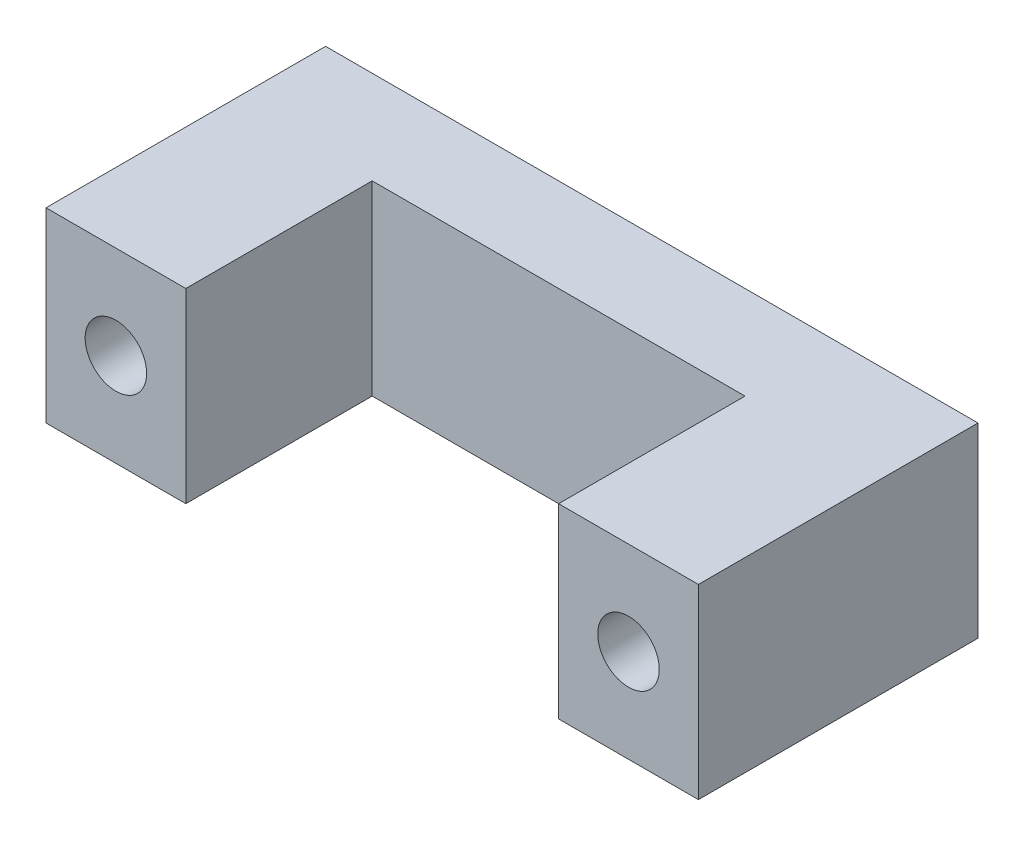
ISO-10303-21;
HEADER;
FILE_DESCRIPTION(('STEP AP214'),'2;1');
FILE_NAME('part.step','',(''),(''),'','','');
FILE_SCHEMA(('AUTOMOTIVE_DESIGN { 1 0 10303 214 1 1 1 1 }'));
ENDSEC;
DATA;
#1=APPLICATION_CONTEXT('core data for automotive mechanical design processes');
#2=APPLICATION_PROTOCOL_DEFINITION('international standard','automotive_design',2000,#1);
#3=PRODUCT_CONTEXT('',#1,'mechanical');
#4=PRODUCT('Part','Part','',(#3));
#5=PRODUCT_RELATED_PRODUCT_CATEGORY('part','',(#4));
#6=PRODUCT_DEFINITION_FORMATION('','',#4);
#7=PRODUCT_DEFINITION_CONTEXT('part definition',#1,'design');
#8=PRODUCT_DEFINITION('design','',#6,#7);
#9=PRODUCT_DEFINITION_SHAPE('','',#8);
#10=(LENGTH_UNIT() NAMED_UNIT(*) SI_UNIT(.MILLI.,.METRE.));
#11=(NAMED_UNIT(*) PLANE_ANGLE_UNIT() SI_UNIT($,.RADIAN.));
#12=(NAMED_UNIT(*) SI_UNIT($,.STERADIAN.) SOLID_ANGLE_UNIT());
#13=UNCERTAINTY_MEASURE_WITH_UNIT(LENGTH_MEASURE(1.E-05),#10,'distance_accuracy_value','');
#14=(GEOMETRIC_REPRESENTATION_CONTEXT(3) GLOBAL_UNCERTAINTY_ASSIGNED_CONTEXT((#13)) GLOBAL_UNIT_ASSIGNED_CONTEXT((#10,
#11,#12)) REPRESENTATION_CONTEXT('',''));
#15=CARTESIAN_POINT('',(0.,0.,0.));
#16=DIRECTION('',(0.,0.,1.));
#17=DIRECTION('',(1.,0.,0.));
#18=AXIS2_PLACEMENT_3D('',#15,#16,#17);
#19=CARTESIAN_POINT('',(0.,0.,15.));
#20=DIRECTION('',(0.,0.,1.));
#21=DIRECTION('',(1.,0.,0.));
#22=AXIS2_PLACEMENT_3D('',#19,#20,#21);
#23=PLANE('',#22);
#24=DIRECTION('',(0.,-1.,0.));
#25=VECTOR('',#24,1.);
#26=CARTESIAN_POINT('',(-10.,-5.00000000000002,15.));
#27=LINE('',#26,#25);
#28=CARTESIAN_POINT('',(-10.,5.00000000000002,15.));
#29=VERTEX_POINT('',#28);
#30=CARTESIAN_POINT('',(-10.,-5.00000000000002,15.));
#31=VERTEX_POINT('',#30);
#32=EDGE_CURVE('E112',#29,#31,#27,.T.);
#33=ORIENTED_EDGE('',*,*,#32,.F.);
#34=DIRECTION('',(-1.,0.,0.));
#35=VECTOR('',#34,1.);
#36=CARTESIAN_POINT('',(17.5,5.00000000000002,15.));
#37=LINE('',#36,#35);
#38=CARTESIAN_POINT('',(-17.5,5.00000000000001,15.));
#39=VERTEX_POINT('',#38);
#40=EDGE_CURVE('E57',#29,#39,#37,.T.);
#41=ORIENTED_EDGE('',*,*,#40,.T.);
#42=DIRECTION('',(0.,-1.,0.));
#43=VECTOR('',#42,1.);
#44=CARTESIAN_POINT('',(-17.5,-4.99999999999999,15.));
#45=LINE('',#44,#43);
#46=CARTESIAN_POINT('',(-17.5,-4.99999999999999,15.));
#47=VERTEX_POINT('',#46);
#48=EDGE_CURVE('E151',#39,#47,#45,.T.);
#49=ORIENTED_EDGE('',*,*,#48,.T.);
#50=DIRECTION('',(1.,0.,0.));
#51=VECTOR('',#50,1.);
#52=CARTESIAN_POINT('',(17.5,-4.99999999999998,15.));
#53=LINE('',#52,#51);
#54=EDGE_CURVE('E86',#47,#31,#53,.T.);
#55=ORIENTED_EDGE('',*,*,#54,.T.);
#56=EDGE_LOOP('',(#33,#41,#49,#55));
#57=FACE_BOUND('',#56,.T.);
#58=CARTESIAN_POINT('',(-13.75,0.,15.));
#59=DIRECTION('',(0.,0.,1.));
#60=DIRECTION('',(1.,0.,0.));
#61=AXIS2_PLACEMENT_3D('',#58,#59,#60);
#62=CIRCLE('',#61,1.65);
#63=CARTESIAN_POINT('',(-12.1,0.,15.));
#64=VERTEX_POINT('',#63);
#65=EDGE_CURVE('E145',#64,#64,#62,.T.);
#66=ORIENTED_EDGE('',*,*,#65,.F.);
#67=EDGE_LOOP('',(#66));
#68=FACE_BOUND('',#67,.T.);
#69=ADVANCED_FACE('F33',(#57,#68),#23,.T.);
#70=DIRECTION('',(0.,1.,0.));
#71=VECTOR('',#70,1.);
#72=CARTESIAN_POINT('',(10.,-5.00000000000002,15.));
#73=LINE('',#72,#71);
#74=CARTESIAN_POINT('',(10.,-5.00000000000002,15.));
#75=VERTEX_POINT('',#74);
#76=CARTESIAN_POINT('',(10.,5.00000000000002,15.));
#77=VERTEX_POINT('',#76);
#78=EDGE_CURVE('E122',#75,#77,#73,.T.);
#79=ORIENTED_EDGE('',*,*,#78,.F.);
#80=CARTESIAN_POINT('',(17.5,-4.99999999999998,15.));
#81=VERTEX_POINT('',#80);
#82=EDGE_CURVE('E153',#75,#81,#53,.T.);
#83=ORIENTED_EDGE('',*,*,#82,.T.);
#84=DIRECTION('',(0.,1.,0.));
#85=VECTOR('',#84,1.);
#86=CARTESIAN_POINT('',(17.5,-4.99999999999998,15.));
#87=LINE('',#86,#85);
#88=CARTESIAN_POINT('',(17.5,5.00000000000002,15.));
#89=VERTEX_POINT('',#88);
#90=EDGE_CURVE('E155',#81,#89,#87,.T.);
#91=ORIENTED_EDGE('',*,*,#90,.T.);
#92=EDGE_CURVE('E157',#89,#77,#37,.T.);
#93=ORIENTED_EDGE('',*,*,#92,.T.);
#94=EDGE_LOOP('',(#79,#83,#91,#93));
#95=FACE_BOUND('',#94,.T.);
#96=CARTESIAN_POINT('',(13.75,0.,15.));
#97=DIRECTION('',(0.,0.,1.));
#98=DIRECTION('',(-1.,0.,0.));
#99=AXIS2_PLACEMENT_3D('',#96,#97,#98);
#100=CIRCLE('',#99,1.65);
#101=CARTESIAN_POINT('',(12.1,0.,15.));
#102=VERTEX_POINT('',#101);
#103=EDGE_CURVE('E139',#102,#102,#100,.T.);
#104=ORIENTED_EDGE('',*,*,#103,.F.);
#105=EDGE_LOOP('',(#104));
#106=FACE_BOUND('',#105,.T.);
#107=ADVANCED_FACE('F187',(#95,#106),#23,.T.);
#108=CARTESIAN_POINT('',(0.,0.,0.));
#109=DIRECTION('',(0.,0.,1.));
#110=DIRECTION('',(1.,0.,0.));
#111=AXIS2_PLACEMENT_3D('',#108,#109,#110);
#112=PLANE('',#111);
#113=DIRECTION('',(0.,-1.,0.));
#114=VECTOR('',#113,1.);
#115=CARTESIAN_POINT('',(-17.5,-4.99999999999999,0.));
#116=LINE('',#115,#114);
#117=CARTESIAN_POINT('',(-17.5,5.00000000000001,0.));
#118=VERTEX_POINT('',#117);
#119=CARTESIAN_POINT('',(-17.5,-4.99999999999999,0.));
#120=VERTEX_POINT('',#119);
#121=EDGE_CURVE('E148',#118,#120,#116,.T.);
#122=ORIENTED_EDGE('',*,*,#121,.F.);
#123=DIRECTION('',(-1.,0.,0.));
#124=VECTOR('',#123,1.);
#125=CARTESIAN_POINT('',(17.5,5.00000000000002,0.));
#126=LINE('',#125,#124);
#127=CARTESIAN_POINT('',(17.5,5.00000000000002,0.));
#128=VERTEX_POINT('',#127);
#129=EDGE_CURVE('E79',#128,#118,#126,.T.);
#130=ORIENTED_EDGE('',*,*,#129,.F.);
#131=DIRECTION('',(0.,1.,0.));
#132=VECTOR('',#131,1.);
#133=CARTESIAN_POINT('',(17.5,-4.99999999999998,0.));
#134=LINE('',#133,#132);
#135=CARTESIAN_POINT('',(17.5,-4.99999999999998,0.));
#136=VERTEX_POINT('',#135);
#137=EDGE_CURVE('E165',#136,#128,#134,.T.);
#138=ORIENTED_EDGE('',*,*,#137,.F.);
#139=DIRECTION('',(1.,0.,0.));
#140=VECTOR('',#139,1.);
#141=CARTESIAN_POINT('',(17.5,-4.99999999999998,0.));
#142=LINE('',#141,#140);
#143=EDGE_CURVE('E163',#120,#136,#142,.T.);
#144=ORIENTED_EDGE('',*,*,#143,.F.);
#145=EDGE_LOOP('',(#122,#130,#138,#144));
#146=FACE_BOUND('',#145,.T.);
#147=CARTESIAN_POINT('',(-13.75,0.,0.));
#148=DIRECTION('',(0.,0.,1.));
#149=DIRECTION('',(1.,0.,0.));
#150=AXIS2_PLACEMENT_3D('',#147,#148,#149);
#151=CIRCLE('',#150,1.65);
#152=CARTESIAN_POINT('',(-12.1,0.,0.));
#153=VERTEX_POINT('',#152);
#154=EDGE_CURVE('E142',#153,#153,#151,.T.);
#155=ORIENTED_EDGE('',*,*,#154,.T.);
#156=EDGE_LOOP('',(#155));
#157=FACE_BOUND('',#156,.T.);
#158=CARTESIAN_POINT('',(13.75,0.,0.));
#159=DIRECTION('',(0.,0.,1.));
#160=DIRECTION('',(-1.,0.,0.));
#161=AXIS2_PLACEMENT_3D('',#158,#159,#160);
#162=CIRCLE('',#161,1.65);
#163=CARTESIAN_POINT('',(12.1,0.,0.));
#164=VERTEX_POINT('',#163);
#165=EDGE_CURVE('E134',#164,#164,#162,.T.);
#166=ORIENTED_EDGE('',*,*,#165,.T.);
#167=EDGE_LOOP('',(#166));
#168=FACE_BOUND('',#167,.T.);
#169=ADVANCED_FACE('F179',(#146,#157,#168),#112,.F.);
#170=CARTESIAN_POINT('',(-17.5,-4.99999999999999,15.));
#171=DIRECTION('',(1.,0.,0.));
#172=DIRECTION('',(0.,0.,-1.));
#173=AXIS2_PLACEMENT_3D('',#170,#171,#172);
#174=PLANE('',#173);
#175=ORIENTED_EDGE('',*,*,#121,.T.);
#176=DIRECTION('',(0.,0.,-1.));
#177=VECTOR('',#176,1.);
#178=CARTESIAN_POINT('',(-17.5,-4.99999999999999,15.));
#179=LINE('',#178,#177);
#180=EDGE_CURVE('E11',#47,#120,#179,.T.);
#181=ORIENTED_EDGE('',*,*,#180,.F.);
#182=ORIENTED_EDGE('',*,*,#48,.F.);
#183=DIRECTION('',(0.,0.,-1.));
#184=VECTOR('',#183,1.);
#185=CARTESIAN_POINT('',(-17.5,5.00000000000001,15.));
#186=LINE('',#185,#184);
#187=EDGE_CURVE('E160',#39,#118,#186,.T.);
#188=ORIENTED_EDGE('',*,*,#187,.T.);
#189=EDGE_LOOP('',(#175,#181,#182,#188));
#190=FACE_BOUND('',#189,.T.);
#191=ADVANCED_FACE('F35',(#190),#174,.F.);
#192=CARTESIAN_POINT('',(17.5,-4.99999999999998,15.));
#193=DIRECTION('',(0.,1.,0.));
#194=DIRECTION('',(-1.,0.,0.));
#195=AXIS2_PLACEMENT_3D('',#192,#193,#194);
#196=PLANE('',#195);
#197=DIRECTION('',(1.,0.,0.));
#198=VECTOR('',#197,1.);
#199=CARTESIAN_POINT('',(10.,-5.00000000000002,5.));
#200=LINE('',#199,#198);
#201=CARTESIAN_POINT('',(-10.,-5.00000000000002,5.));
#202=VERTEX_POINT('',#201);
#203=CARTESIAN_POINT('',(10.,-5.00000000000002,5.));
#204=VERTEX_POINT('',#203);
#205=EDGE_CURVE('E118',#202,#204,#200,.T.);
#206=ORIENTED_EDGE('',*,*,#205,.F.);
#207=DIRECTION('',(0.,0.,1.));
#208=VECTOR('',#207,1.);
#209=CARTESIAN_POINT('',(-10.,-5.00000000000002,5.));
#210=LINE('',#209,#208);
#211=EDGE_CURVE('E108',#202,#31,#210,.T.);
#212=ORIENTED_EDGE('',*,*,#211,.T.);
#213=ORIENTED_EDGE('',*,*,#54,.F.);
#214=ORIENTED_EDGE('',*,*,#180,.T.);
#215=ORIENTED_EDGE('',*,*,#143,.T.);
#216=DIRECTION('',(0.,0.,-1.));
#217=VECTOR('',#216,1.);
#218=CARTESIAN_POINT('',(17.5,-4.99999999999998,15.));
#219=LINE('',#218,#217);
#220=EDGE_CURVE('E41',#81,#136,#219,.T.);
#221=ORIENTED_EDGE('',*,*,#220,.F.);
#222=ORIENTED_EDGE('',*,*,#82,.F.);
#223=DIRECTION('',(0.,0.,1.));
#224=VECTOR('',#223,1.);
#225=CARTESIAN_POINT('',(10.,-5.00000000000002,5.));
#226=LINE('',#225,#224);
#227=EDGE_CURVE('E114',#204,#75,#226,.T.);
#228=ORIENTED_EDGE('',*,*,#227,.F.);
#229=EDGE_LOOP('',(#206,#212,#213,#214,#215,#221,#222,#228));
#230=FACE_BOUND('',#229,.T.);
#231=ADVANCED_FACE('F124',(#230),#196,.F.);
#232=CARTESIAN_POINT('',(17.5,-4.99999999999998,15.));
#233=DIRECTION('',(-1.,0.,0.));
#234=DIRECTION('',(0.,0.,1.));
#235=AXIS2_PLACEMENT_3D('',#232,#233,#234);
#236=PLANE('',#235);
#237=ORIENTED_EDGE('',*,*,#137,.T.);
#238=DIRECTION('',(0.,0.,-1.));
#239=VECTOR('',#238,1.);
#240=CARTESIAN_POINT('',(17.5,5.00000000000002,15.));
#241=LINE('',#240,#239);
#242=EDGE_CURVE('E169',#89,#128,#241,.T.);
#243=ORIENTED_EDGE('',*,*,#242,.F.);
#244=ORIENTED_EDGE('',*,*,#90,.F.);
#245=ORIENTED_EDGE('',*,*,#220,.T.);
#246=EDGE_LOOP('',(#237,#243,#244,#245));
#247=FACE_BOUND('',#246,.T.);
#248=ADVANCED_FACE('F175',(#247),#236,.F.);
#249=CARTESIAN_POINT('',(17.5,5.00000000000002,15.));
#250=DIRECTION('',(0.,-1.,0.));
#251=DIRECTION('',(1.,0.,0.));
#252=AXIS2_PLACEMENT_3D('',#249,#250,#251);
#253=PLANE('',#252);
#254=ORIENTED_EDGE('',*,*,#40,.F.);
#255=DIRECTION('',(0.,0.,1.));
#256=VECTOR('',#255,1.);
#257=CARTESIAN_POINT('',(-10.,5.00000000000002,5.));
#258=LINE('',#257,#256);
#259=CARTESIAN_POINT('',(-10.,5.00000000000002,5.));
#260=VERTEX_POINT('',#259);
#261=EDGE_CURVE('E132',#260,#29,#258,.T.);
#262=ORIENTED_EDGE('',*,*,#261,.F.);
#263=DIRECTION('',(-1.,0.,0.));
#264=VECTOR('',#263,1.);
#265=CARTESIAN_POINT('',(10.,5.00000000000002,5.));
#266=LINE('',#265,#264);
#267=CARTESIAN_POINT('',(10.,5.00000000000002,5.));
#268=VERTEX_POINT('',#267);
#269=EDGE_CURVE('E115',#268,#260,#266,.T.);
#270=ORIENTED_EDGE('',*,*,#269,.F.);
#271=DIRECTION('',(0.,0.,1.));
#272=VECTOR('',#271,1.);
#273=CARTESIAN_POINT('',(10.,5.00000000000002,5.));
#274=LINE('',#273,#272);
#275=EDGE_CURVE('E135',#268,#77,#274,.T.);
#276=ORIENTED_EDGE('',*,*,#275,.T.);
#277=ORIENTED_EDGE('',*,*,#92,.F.);
#278=ORIENTED_EDGE('',*,*,#242,.T.);
#279=ORIENTED_EDGE('',*,*,#129,.T.);
#280=ORIENTED_EDGE('',*,*,#187,.F.);
#281=EDGE_LOOP('',(#254,#262,#270,#276,#277,#278,#279,#280));
#282=FACE_BOUND('',#281,.T.);
#283=ADVANCED_FACE('F184',(#282),#253,.F.);
#284=CARTESIAN_POINT('',(-13.75,0.,15.));
#285=DIRECTION('',(0.,0.,-1.));
#286=DIRECTION('',(-1.,0.,0.));
#287=AXIS2_PLACEMENT_3D('',#284,#285,#286);
#288=CYLINDRICAL_SURFACE('',#287,1.65);
#289=ORIENTED_EDGE('',*,*,#65,.T.);
#290=EDGE_LOOP('',(#289));
#291=FACE_BOUND('',#290,.T.);
#292=ORIENTED_EDGE('',*,*,#154,.F.);
#293=EDGE_LOOP('',(#292));
#294=FACE_BOUND('',#293,.T.);
#295=ADVANCED_FACE('F191',(#291,#294),#288,.F.);
#296=CARTESIAN_POINT('',(13.75,0.,15.));
#297=DIRECTION('',(0.,0.,-1.));
#298=DIRECTION('',(-1.,0.,0.));
#299=AXIS2_PLACEMENT_3D('',#296,#297,#298);
#300=CYLINDRICAL_SURFACE('',#299,1.65);
#301=ORIENTED_EDGE('',*,*,#103,.T.);
#302=EDGE_LOOP('',(#301));
#303=FACE_BOUND('',#302,.T.);
#304=ORIENTED_EDGE('',*,*,#165,.F.);
#305=EDGE_LOOP('',(#304));
#306=FACE_BOUND('',#305,.T.);
#307=ADVANCED_FACE('F194',(#303,#306),#300,.F.);
#308=CARTESIAN_POINT('',(-10.,-5.00000000000002,5.));
#309=DIRECTION('',(-1.,0.,0.));
#310=DIRECTION('',(0.,0.,1.));
#311=AXIS2_PLACEMENT_3D('',#308,#309,#310);
#312=PLANE('',#311);
#313=ORIENTED_EDGE('',*,*,#32,.T.);
#314=ORIENTED_EDGE('',*,*,#211,.F.);
#315=DIRECTION('',(0.,-1.,0.));
#316=VECTOR('',#315,1.);
#317=CARTESIAN_POINT('',(-10.,-5.00000000000002,5.));
#318=LINE('',#317,#316);
#319=EDGE_CURVE('E111',#260,#202,#318,.T.);
#320=ORIENTED_EDGE('',*,*,#319,.F.);
#321=ORIENTED_EDGE('',*,*,#261,.T.);
#322=EDGE_LOOP('',(#313,#314,#320,#321));
#323=FACE_BOUND('',#322,.T.);
#324=ADVANCED_FACE('F110',(#323),#312,.F.);
#325=CARTESIAN_POINT('',(10.,-5.00000000000002,5.));
#326=DIRECTION('',(1.,0.,0.));
#327=DIRECTION('',(0.,0.,-1.));
#328=AXIS2_PLACEMENT_3D('',#325,#326,#327);
#329=PLANE('',#328);
#330=ORIENTED_EDGE('',*,*,#78,.T.);
#331=ORIENTED_EDGE('',*,*,#275,.F.);
#332=DIRECTION('',(0.,1.,0.));
#333=VECTOR('',#332,1.);
#334=CARTESIAN_POINT('',(10.,-5.00000000000002,5.));
#335=LINE('',#334,#333);
#336=EDGE_CURVE('E48',#204,#268,#335,.T.);
#337=ORIENTED_EDGE('',*,*,#336,.F.);
#338=ORIENTED_EDGE('',*,*,#227,.T.);
#339=EDGE_LOOP('',(#330,#331,#337,#338));
#340=FACE_BOUND('',#339,.T.);
#341=ADVANCED_FACE('F208',(#340),#329,.F.);
#342=CARTESIAN_POINT('',(0.,0.,5.));
#343=DIRECTION('',(0.,0.,1.));
#344=DIRECTION('',(1.,0.,0.));
#345=AXIS2_PLACEMENT_3D('',#342,#343,#344);
#346=PLANE('',#345);
#347=ORIENTED_EDGE('',*,*,#319,.T.);
#348=ORIENTED_EDGE('',*,*,#205,.T.);
#349=ORIENTED_EDGE('',*,*,#336,.T.);
#350=ORIENTED_EDGE('',*,*,#269,.T.);
#351=EDGE_LOOP('',(#347,#348,#349,#350));
#352=FACE_BOUND('',#351,.T.);
#353=ADVANCED_FACE('F117',(#352),#346,.T.);
#354=CLOSED_SHELL('',(#69,#107,#169,#191,#231,#248,#283,#295,#307,#324,#341,#353));
#355=MANIFOLD_SOLID_BREP('B2',#354);
#356=ADVANCED_BREP_SHAPE_REPRESENTATION('',(#18,#355),#14);
#357=SHAPE_DEFINITION_REPRESENTATION(#9,#356);
ENDSEC;
END-ISO-10303-21;
